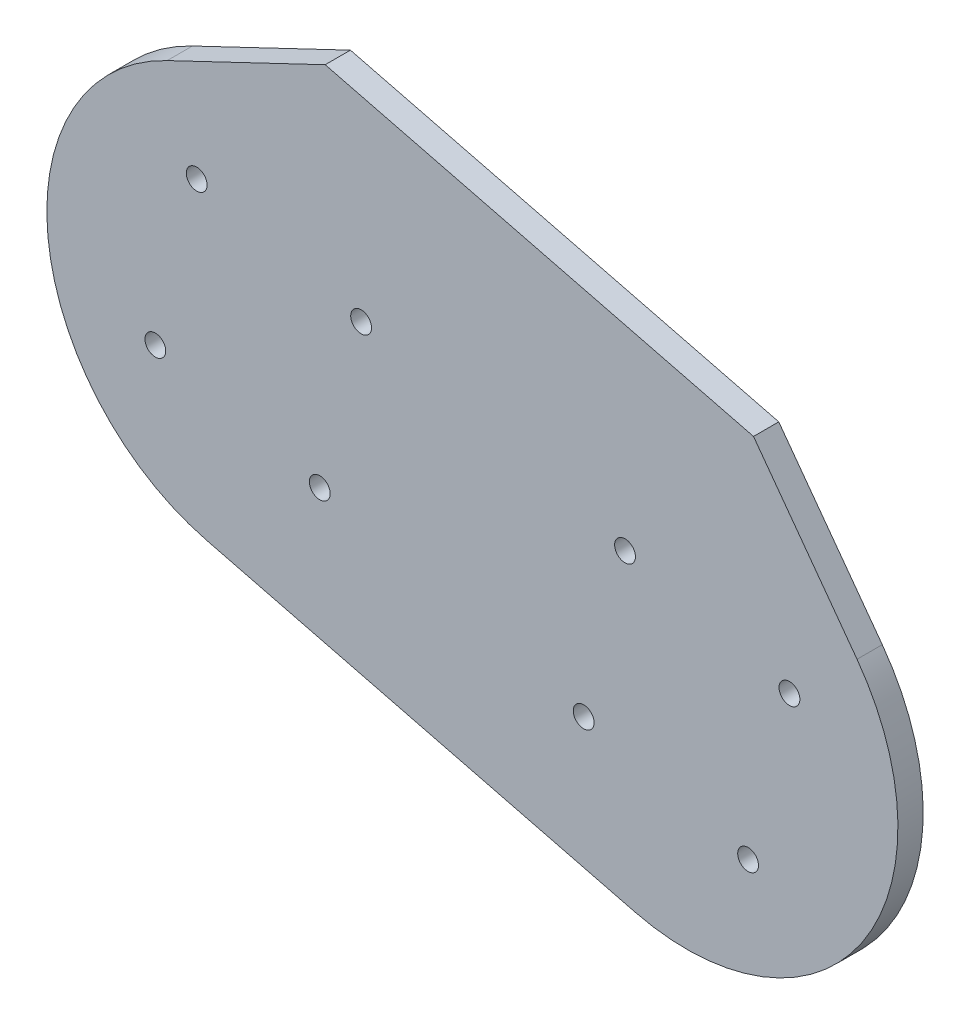
ISO-10303-21;
HEADER;
FILE_DESCRIPTION(('STEP AP214'),'2;1');
FILE_NAME('part.step','',(''),(''),'','','');
FILE_SCHEMA(('AUTOMOTIVE_DESIGN { 1 0 10303 214 1 1 1 1 }'));
ENDSEC;
DATA;
#1=APPLICATION_CONTEXT('core data for automotive mechanical design processes');
#2=APPLICATION_PROTOCOL_DEFINITION('international standard','automotive_design',2000,#1);
#3=PRODUCT_CONTEXT('',#1,'mechanical');
#4=PRODUCT('Part','Part','',(#3));
#5=PRODUCT_RELATED_PRODUCT_CATEGORY('part','',(#4));
#6=PRODUCT_DEFINITION_FORMATION('','',#4);
#7=PRODUCT_DEFINITION_CONTEXT('part definition',#1,'design');
#8=PRODUCT_DEFINITION('design','',#6,#7);
#9=PRODUCT_DEFINITION_SHAPE('','',#8);
#10=(LENGTH_UNIT() NAMED_UNIT(*) SI_UNIT(.MILLI.,.METRE.));
#11=(NAMED_UNIT(*) PLANE_ANGLE_UNIT() SI_UNIT($,.RADIAN.));
#12=(NAMED_UNIT(*) SI_UNIT($,.STERADIAN.) SOLID_ANGLE_UNIT());
#13=UNCERTAINTY_MEASURE_WITH_UNIT(LENGTH_MEASURE(1.E-05),#10,'distance_accuracy_value','');
#14=(GEOMETRIC_REPRESENTATION_CONTEXT(3) GLOBAL_UNCERTAINTY_ASSIGNED_CONTEXT((#13)) GLOBAL_UNIT_ASSIGNED_CONTEXT((#10,
#11,#12)) REPRESENTATION_CONTEXT('',''));
#15=CARTESIAN_POINT('',(0.,0.,0.));
#16=DIRECTION('',(0.,0.,1.));
#17=DIRECTION('',(1.,0.,0.));
#18=AXIS2_PLACEMENT_3D('',#15,#16,#17);
#19=CARTESIAN_POINT('',(365.151200551185,-296.900822554976,4.));
#20=DIRECTION('',(0.,0.,1.));
#21=DIRECTION('',(1.,0.,0.));
#22=AXIS2_PLACEMENT_3D('',#19,#20,#21);
#23=PLANE('',#22);
#24=CARTESIAN_POINT('',(416.729715460648,-323.729030877152,4.));
#25=DIRECTION('',(0.,0.,1.));
#26=DIRECTION('',(1.,0.,0.));
#27=AXIS2_PLACEMENT_3D('',#24,#25,#26);
#28=CIRCLE('',#27,1.64999999999999);
#29=CARTESIAN_POINT('',(418.379715460648,-323.729030877152,4.));
#30=VERTEX_POINT('',#29);
#31=EDGE_CURVE('E207',#30,#30,#28,.T.);
#32=ORIENTED_EDGE('',*,*,#31,.F.);
#33=EDGE_LOOP('',(#32));
#34=FACE_BOUND('',#33,.T.);
#35=CARTESIAN_POINT('',(423.284694528252,-297.67078363327,4.));
#36=DIRECTION('',(0.,0.,1.));
#37=DIRECTION('',(1.,0.,0.));
#38=AXIS2_PLACEMENT_3D('',#35,#36,#37);
#39=CIRCLE('',#38,1.64999999999999);
#40=CARTESIAN_POINT('',(424.934694528252,-297.67078363327,4.));
#41=VERTEX_POINT('',#40);
#42=EDGE_CURVE('E219',#41,#41,#39,.T.);
#43=ORIENTED_EDGE('',*,*,#42,.F.);
#44=EDGE_LOOP('',(#43));
#45=FACE_BOUND('',#44,.T.);
#46=CARTESIAN_POINT('',(348.844587395442,-306.652456643114,4.));
#47=DIRECTION('',(0.,0.,1.));
#48=DIRECTION('',(1.,0.,0.));
#49=AXIS2_PLACEMENT_3D('',#46,#47,#48);
#50=CIRCLE('',#49,1.64999999999999);
#51=CARTESIAN_POINT('',(350.494587395442,-306.652456643114,4.));
#52=VERTEX_POINT('',#51);
#53=EDGE_CURVE('E231',#52,#52,#50,.T.);
#54=ORIENTED_EDGE('',*,*,#53,.F.);
#55=EDGE_LOOP('',(#54));
#56=FACE_BOUND('',#55,.T.);
#57=CARTESIAN_POINT('',(355.399566463046,-280.594209399233,4.));
#58=DIRECTION('',(0.,0.,1.));
#59=DIRECTION('',(1.,0.,0.));
#60=AXIS2_PLACEMENT_3D('',#57,#58,#59);
#61=CIRCLE('',#60,1.64999999999999);
#62=CARTESIAN_POINT('',(357.049566463046,-280.594209399233,4.));
#63=VERTEX_POINT('',#62);
#64=EDGE_CURVE('E124',#63,#63,#61,.T.);
#65=ORIENTED_EDGE('',*,*,#64,.F.);
#66=EDGE_LOOP('',(#65));
#67=FACE_BOUND('',#66,.T.);
#68=DIRECTION('',(-0.90246551540635,-0.430762107783811,0.));
#69=VECTOR('',#68,1.);
#70=CARTESIAN_POINT('',(375.763071682337,-254.715064400169,4.));
#71=LINE('',#70,#69);
#72=CARTESIAN_POINT('',(375.763071682337,-254.715064400169,4.));
#73=VERTEX_POINT('',#72);
#74=CARTESIAN_POINT('',(350.720669940428,-266.668227788863,4.));
#75=VERTEX_POINT('',#74);
#76=EDGE_CURVE('E131',#73,#75,#71,.T.);
#77=ORIENTED_EDGE('',*,*,#76,.T.);
#78=CARTESIAN_POINT('',(365.151200551185,-296.900822554976,4.));
#79=DIRECTION('',(0.,0.,1.));
#80=DIRECTION('',(1.,0.,0.));
#81=AXIS2_PLACEMENT_3D('',#78,#79,#80);
#82=CIRCLE('',#81,33.5);
#83=CARTESIAN_POINT('',(356.978840024896,-329.388705271896,4.));
#84=VERTEX_POINT('',#83);
#85=EDGE_CURVE('E89',#75,#84,#82,.T.);
#86=ORIENTED_EDGE('',*,*,#85,.T.);
#87=DIRECTION('',(0.969787543788656,-0.243951060486251,0.));
#88=VECTOR('',#87,1.);
#89=CARTESIAN_POINT('',(356.978840024896,-329.388705271896,4.));
#90=LINE('',#89,#88);
#91=CARTESIAN_POINT('',(424.863968090102,-346.465279505933,4.));
#92=VERTEX_POINT('',#91);
#93=EDGE_CURVE('E102',#84,#92,#90,.T.);
#94=ORIENTED_EDGE('',*,*,#93,.T.);
#95=CARTESIAN_POINT('',(433.036328616391,-313.977396789013,4.));
#96=DIRECTION('',(0.,0.,1.));
#97=DIRECTION('',(1.,0.,0.));
#98=AXIS2_PLACEMENT_3D('',#95,#96,#97);
#99=CIRCLE('',#98,33.5);
#100=CARTESIAN_POINT('',(460.054173141203,-294.171183692284,4.));
#101=VERTEX_POINT('',#100);
#102=EDGE_CURVE('E96',#92,#101,#99,.T.);
#103=ORIENTED_EDGE('',*,*,#102,.T.);
#104=DIRECTION('',(-0.591230241693418,0.806502821636194,0.));
#105=VECTOR('',#104,1.);
#106=CARTESIAN_POINT('',(443.648199747543,-271.791638634207,4.));
#107=LINE('',#106,#105);
#108=CARTESIAN_POINT('',(443.648199747543,-271.791638634207,4.));
#109=VERTEX_POINT('',#108);
#110=EDGE_CURVE('E100',#101,#109,#107,.T.);
#111=ORIENTED_EDGE('',*,*,#110,.T.);
#112=DIRECTION('',(-0.969787543788655,0.243951060486252,0.));
#113=VECTOR('',#112,1.);
#114=CARTESIAN_POINT('',(375.763071682337,-254.715064400169,4.));
#115=LINE('',#114,#113);
#116=EDGE_CURVE('E52',#109,#73,#115,.T.);
#117=ORIENTED_EDGE('',*,*,#116,.T.);
#118=EDGE_LOOP('',(#77,#86,#94,#103,#111,#117));
#119=FACE_BOUND('',#118,.T.);
#120=CARTESIAN_POINT('',(381.457813706928,-287.149188466837,4.));
#121=DIRECTION('',(0.,0.,1.));
#122=DIRECTION('',(1.,0.,0.));
#123=AXIS2_PLACEMENT_3D('',#120,#121,#122);
#124=CIRCLE('',#123,1.64999999999999);
#125=CARTESIAN_POINT('',(383.107813706928,-287.149188466837,4.));
#126=VERTEX_POINT('',#125);
#127=EDGE_CURVE('E237',#126,#126,#124,.T.);
#128=ORIENTED_EDGE('',*,*,#127,.F.);
#129=EDGE_LOOP('',(#128));
#130=FACE_BOUND('',#129,.T.);
#131=CARTESIAN_POINT('',(374.902834639324,-313.207435710719,4.));
#132=DIRECTION('',(0.,0.,1.));
#133=DIRECTION('',(1.,0.,0.));
#134=AXIS2_PLACEMENT_3D('',#131,#132,#133);
#135=CIRCLE('',#134,1.64999999999999);
#136=CARTESIAN_POINT('',(376.552834639324,-313.207435710719,4.));
#137=VERTEX_POINT('',#136);
#138=EDGE_CURVE('E225',#137,#137,#135,.T.);
#139=ORIENTED_EDGE('',*,*,#138,.F.);
#140=EDGE_LOOP('',(#139));
#141=FACE_BOUND('',#140,.T.);
#142=CARTESIAN_POINT('',(449.342941772134,-304.225762700874,4.));
#143=DIRECTION('',(0.,0.,1.));
#144=DIRECTION('',(1.,0.,0.));
#145=AXIS2_PLACEMENT_3D('',#142,#143,#144);
#146=CIRCLE('',#145,1.64999999999999);
#147=CARTESIAN_POINT('',(450.992941772134,-304.225762700874,4.));
#148=VERTEX_POINT('',#147);
#149=EDGE_CURVE('E213',#148,#148,#146,.T.);
#150=ORIENTED_EDGE('',*,*,#149,.F.);
#151=EDGE_LOOP('',(#150));
#152=FACE_BOUND('',#151,.T.);
#153=CARTESIAN_POINT('',(442.78796270453,-330.284009944756,4.));
#154=DIRECTION('',(0.,0.,1.));
#155=DIRECTION('',(1.,0.,0.));
#156=AXIS2_PLACEMENT_3D('',#153,#154,#155);
#157=CIRCLE('',#156,1.64999999999999);
#158=CARTESIAN_POINT('',(444.43796270453,-330.284009944756,4.));
#159=VERTEX_POINT('',#158);
#160=EDGE_CURVE('E198',#159,#159,#157,.T.);
#161=ORIENTED_EDGE('',*,*,#160,.F.);
#162=EDGE_LOOP('',(#161));
#163=FACE_BOUND('',#162,.T.);
#164=ADVANCED_FACE('F35',(#34,#45,#56,#67,#119,#130,#141,#152,#163),#23,.T.);
#165=CARTESIAN_POINT('',(365.151200551185,-296.900822554976,0.));
#166=DIRECTION('',(0.,0.,1.));
#167=DIRECTION('',(1.,0.,0.));
#168=AXIS2_PLACEMENT_3D('',#165,#166,#167);
#169=PLANE('',#168);
#170=DIRECTION('',(-0.90246551540635,-0.430762107783811,0.));
#171=VECTOR('',#170,1.);
#172=CARTESIAN_POINT('',(375.763071682337,-254.715064400169,0.));
#173=LINE('',#172,#171);
#174=CARTESIAN_POINT('',(375.763071682337,-254.715064400169,0.));
#175=VERTEX_POINT('',#174);
#176=CARTESIAN_POINT('',(350.720669940428,-266.668227788863,0.));
#177=VERTEX_POINT('',#176);
#178=EDGE_CURVE('E120',#175,#177,#173,.T.);
#179=ORIENTED_EDGE('',*,*,#178,.F.);
#180=DIRECTION('',(-0.969787543788655,0.243951060486252,0.));
#181=VECTOR('',#180,1.);
#182=CARTESIAN_POINT('',(375.763071682337,-254.715064400169,0.));
#183=LINE('',#182,#181);
#184=CARTESIAN_POINT('',(443.648199747543,-271.791638634207,0.));
#185=VERTEX_POINT('',#184);
#186=EDGE_CURVE('E81',#185,#175,#183,.T.);
#187=ORIENTED_EDGE('',*,*,#186,.F.);
#188=DIRECTION('',(-0.591230241693418,0.806502821636194,0.));
#189=VECTOR('',#188,1.);
#190=CARTESIAN_POINT('',(443.648199747543,-271.791638634207,0.));
#191=LINE('',#190,#189);
#192=CARTESIAN_POINT('',(460.054173141203,-294.171183692284,0.));
#193=VERTEX_POINT('',#192);
#194=EDGE_CURVE('E75',#193,#185,#191,.T.);
#195=ORIENTED_EDGE('',*,*,#194,.F.);
#196=CARTESIAN_POINT('',(433.036328616391,-313.977396789013,0.));
#197=DIRECTION('',(0.,0.,1.));
#198=DIRECTION('',(1.,0.,0.));
#199=AXIS2_PLACEMENT_3D('',#196,#197,#198);
#200=CIRCLE('',#199,33.5);
#201=CARTESIAN_POINT('',(424.863968090102,-346.465279505933,0.));
#202=VERTEX_POINT('',#201);
#203=EDGE_CURVE('E110',#202,#193,#200,.T.);
#204=ORIENTED_EDGE('',*,*,#203,.F.);
#205=DIRECTION('',(0.969787543788656,-0.243951060486251,0.));
#206=VECTOR('',#205,1.);
#207=CARTESIAN_POINT('',(356.978840024896,-329.388705271896,0.));
#208=LINE('',#207,#206);
#209=CARTESIAN_POINT('',(356.978840024896,-329.388705271896,0.));
#210=VERTEX_POINT('',#209);
#211=EDGE_CURVE('E126',#210,#202,#208,.T.);
#212=ORIENTED_EDGE('',*,*,#211,.F.);
#213=CARTESIAN_POINT('',(365.151200551185,-296.900822554976,0.));
#214=DIRECTION('',(0.,0.,1.));
#215=DIRECTION('',(1.,0.,0.));
#216=AXIS2_PLACEMENT_3D('',#213,#214,#215);
#217=CIRCLE('',#216,33.5);
#218=EDGE_CURVE('E123',#177,#210,#217,.T.);
#219=ORIENTED_EDGE('',*,*,#218,.F.);
#220=EDGE_LOOP('',(#179,#187,#195,#204,#212,#219));
#221=FACE_BOUND('',#220,.T.);
#222=CARTESIAN_POINT('',(355.399566463046,-280.594209399233,0.));
#223=DIRECTION('',(0.,0.,1.));
#224=DIRECTION('',(1.,0.,0.));
#225=AXIS2_PLACEMENT_3D('',#222,#223,#224);
#226=CIRCLE('',#225,1.64999999999999);
#227=CARTESIAN_POINT('',(357.049566463046,-280.594209399233,0.));
#228=VERTEX_POINT('',#227);
#229=EDGE_CURVE('E240',#228,#228,#226,.T.);
#230=ORIENTED_EDGE('',*,*,#229,.T.);
#231=EDGE_LOOP('',(#230));
#232=FACE_BOUND('',#231,.T.);
#233=CARTESIAN_POINT('',(381.457813706928,-287.149188466837,0.));
#234=DIRECTION('',(0.,0.,1.));
#235=DIRECTION('',(1.,0.,0.));
#236=AXIS2_PLACEMENT_3D('',#233,#234,#235);
#237=CIRCLE('',#236,1.64999999999999);
#238=CARTESIAN_POINT('',(383.107813706928,-287.149188466837,0.));
#239=VERTEX_POINT('',#238);
#240=EDGE_CURVE('E234',#239,#239,#237,.T.);
#241=ORIENTED_EDGE('',*,*,#240,.T.);
#242=EDGE_LOOP('',(#241));
#243=FACE_BOUND('',#242,.T.);
#244=CARTESIAN_POINT('',(348.844587395442,-306.652456643114,0.));
#245=DIRECTION('',(0.,0.,1.));
#246=DIRECTION('',(1.,0.,0.));
#247=AXIS2_PLACEMENT_3D('',#244,#245,#246);
#248=CIRCLE('',#247,1.64999999999999);
#249=CARTESIAN_POINT('',(350.494587395442,-306.652456643114,0.));
#250=VERTEX_POINT('',#249);
#251=EDGE_CURVE('E228',#250,#250,#248,.T.);
#252=ORIENTED_EDGE('',*,*,#251,.T.);
#253=EDGE_LOOP('',(#252));
#254=FACE_BOUND('',#253,.T.);
#255=CARTESIAN_POINT('',(374.902834639324,-313.207435710719,0.));
#256=DIRECTION('',(0.,0.,1.));
#257=DIRECTION('',(1.,0.,0.));
#258=AXIS2_PLACEMENT_3D('',#255,#256,#257);
#259=CIRCLE('',#258,1.64999999999999);
#260=CARTESIAN_POINT('',(376.552834639324,-313.207435710719,0.));
#261=VERTEX_POINT('',#260);
#262=EDGE_CURVE('E222',#261,#261,#259,.T.);
#263=ORIENTED_EDGE('',*,*,#262,.T.);
#264=EDGE_LOOP('',(#263));
#265=FACE_BOUND('',#264,.T.);
#266=CARTESIAN_POINT('',(423.284694528252,-297.67078363327,0.));
#267=DIRECTION('',(0.,0.,1.));
#268=DIRECTION('',(1.,0.,0.));
#269=AXIS2_PLACEMENT_3D('',#266,#267,#268);
#270=CIRCLE('',#269,1.64999999999999);
#271=CARTESIAN_POINT('',(424.934694528252,-297.67078363327,0.));
#272=VERTEX_POINT('',#271);
#273=EDGE_CURVE('E216',#272,#272,#270,.T.);
#274=ORIENTED_EDGE('',*,*,#273,.T.);
#275=EDGE_LOOP('',(#274));
#276=FACE_BOUND('',#275,.T.);
#277=CARTESIAN_POINT('',(449.342941772134,-304.225762700874,0.));
#278=DIRECTION('',(0.,0.,1.));
#279=DIRECTION('',(1.,0.,0.));
#280=AXIS2_PLACEMENT_3D('',#277,#278,#279);
#281=CIRCLE('',#280,1.64999999999999);
#282=CARTESIAN_POINT('',(450.992941772134,-304.225762700874,0.));
#283=VERTEX_POINT('',#282);
#284=EDGE_CURVE('E210',#283,#283,#281,.T.);
#285=ORIENTED_EDGE('',*,*,#284,.T.);
#286=EDGE_LOOP('',(#285));
#287=FACE_BOUND('',#286,.T.);
#288=CARTESIAN_POINT('',(416.729715460648,-323.729030877152,0.));
#289=DIRECTION('',(0.,0.,1.));
#290=DIRECTION('',(1.,0.,0.));
#291=AXIS2_PLACEMENT_3D('',#288,#289,#290);
#292=CIRCLE('',#291,1.64999999999999);
#293=CARTESIAN_POINT('',(418.379715460648,-323.729030877152,0.));
#294=VERTEX_POINT('',#293);
#295=EDGE_CURVE('E204',#294,#294,#292,.T.);
#296=ORIENTED_EDGE('',*,*,#295,.T.);
#297=EDGE_LOOP('',(#296));
#298=FACE_BOUND('',#297,.T.);
#299=CARTESIAN_POINT('',(442.78796270453,-330.284009944756,0.));
#300=DIRECTION('',(0.,0.,1.));
#301=DIRECTION('',(1.,0.,0.));
#302=AXIS2_PLACEMENT_3D('',#299,#300,#301);
#303=CIRCLE('',#302,1.64999999999999);
#304=CARTESIAN_POINT('',(444.43796270453,-330.284009944756,0.));
#305=VERTEX_POINT('',#304);
#306=EDGE_CURVE('E201',#305,#305,#303,.T.);
#307=ORIENTED_EDGE('',*,*,#306,.T.);
#308=EDGE_LOOP('',(#307));
#309=FACE_BOUND('',#308,.T.);
#310=ADVANCED_FACE('F140',(#221,#232,#243,#254,#265,#276,#287,#298,#309),#169,.F.);
#311=CARTESIAN_POINT('',(375.763071682337,-254.715064400169,4.));
#312=DIRECTION('',(0.430762107783811,-0.90246551540635,0.));
#313=DIRECTION('',(0.90246551540635,0.430762107783811,0.));
#314=AXIS2_PLACEMENT_3D('',#311,#312,#313);
#315=PLANE('',#314);
#316=ORIENTED_EDGE('',*,*,#178,.T.);
#317=DIRECTION('',(0.,0.,-1.));
#318=VECTOR('',#317,1.);
#319=CARTESIAN_POINT('',(350.720669940428,-266.668227788863,4.));
#320=LINE('',#319,#318);
#321=EDGE_CURVE('E11',#75,#177,#320,.T.);
#322=ORIENTED_EDGE('',*,*,#321,.F.);
#323=ORIENTED_EDGE('',*,*,#76,.F.);
#324=DIRECTION('',(0.,0.,-1.));
#325=VECTOR('',#324,1.);
#326=CARTESIAN_POINT('',(375.763071682337,-254.715064400169,4.));
#327=LINE('',#326,#325);
#328=EDGE_CURVE('E116',#73,#175,#327,.T.);
#329=ORIENTED_EDGE('',*,*,#328,.T.);
#330=EDGE_LOOP('',(#316,#322,#323,#329));
#331=FACE_BOUND('',#330,.T.);
#332=ADVANCED_FACE('F37',(#331),#315,.F.);
#333=CARTESIAN_POINT('',(365.151200551185,-296.900822554976,4.));
#334=DIRECTION('',(0.,0.,-1.));
#335=DIRECTION('',(-1.,0.,0.));
#336=AXIS2_PLACEMENT_3D('',#333,#334,#335);
#337=CYLINDRICAL_SURFACE('',#336,33.5);
#338=ORIENTED_EDGE('',*,*,#218,.T.);
#339=DIRECTION('',(0.,0.,-1.));
#340=VECTOR('',#339,1.);
#341=CARTESIAN_POINT('',(356.978840024896,-329.388705271896,4.));
#342=LINE('',#341,#340);
#343=EDGE_CURVE('E44',#84,#210,#342,.T.);
#344=ORIENTED_EDGE('',*,*,#343,.F.);
#345=ORIENTED_EDGE('',*,*,#85,.F.);
#346=ORIENTED_EDGE('',*,*,#321,.T.);
#347=EDGE_LOOP('',(#338,#344,#345,#346));
#348=FACE_BOUND('',#347,.T.);
#349=ADVANCED_FACE('F334',(#348),#337,.T.);
#350=CARTESIAN_POINT('',(356.978840024896,-329.388705271896,4.));
#351=DIRECTION('',(0.243951060486251,0.969787543788656,0.));
#352=DIRECTION('',(-0.969787543788656,0.243951060486251,0.));
#353=AXIS2_PLACEMENT_3D('',#350,#351,#352);
#354=PLANE('',#353);
#355=ORIENTED_EDGE('',*,*,#211,.T.);
#356=DIRECTION('',(0.,0.,-1.));
#357=VECTOR('',#356,1.);
#358=CARTESIAN_POINT('',(424.863968090102,-346.465279505933,4.));
#359=LINE('',#358,#357);
#360=EDGE_CURVE('E111',#92,#202,#359,.T.);
#361=ORIENTED_EDGE('',*,*,#360,.F.);
#362=ORIENTED_EDGE('',*,*,#93,.F.);
#363=ORIENTED_EDGE('',*,*,#343,.T.);
#364=EDGE_LOOP('',(#355,#361,#362,#363));
#365=FACE_BOUND('',#364,.T.);
#366=ADVANCED_FACE('F137',(#365),#354,.F.);
#367=CARTESIAN_POINT('',(433.036328616391,-313.977396789013,4.));
#368=DIRECTION('',(0.,0.,-1.));
#369=DIRECTION('',(-1.,0.,0.));
#370=AXIS2_PLACEMENT_3D('',#367,#368,#369);
#371=CYLINDRICAL_SURFACE('',#370,33.5);
#372=ORIENTED_EDGE('',*,*,#203,.T.);
#373=DIRECTION('',(0.,0.,-1.));
#374=VECTOR('',#373,1.);
#375=CARTESIAN_POINT('',(460.054173141203,-294.171183692284,4.));
#376=LINE('',#375,#374);
#377=EDGE_CURVE('E107',#101,#193,#376,.T.);
#378=ORIENTED_EDGE('',*,*,#377,.F.);
#379=ORIENTED_EDGE('',*,*,#102,.F.);
#380=ORIENTED_EDGE('',*,*,#360,.T.);
#381=EDGE_LOOP('',(#372,#378,#379,#380));
#382=FACE_BOUND('',#381,.T.);
#383=ADVANCED_FACE('F108',(#382),#371,.T.);
#384=CARTESIAN_POINT('',(443.648199747543,-271.791638634207,4.));
#385=DIRECTION('',(-0.806502821636194,-0.591230241693418,0.));
#386=DIRECTION('',(0.591230241693418,-0.806502821636194,0.));
#387=AXIS2_PLACEMENT_3D('',#384,#385,#386);
#388=PLANE('',#387);
#389=ORIENTED_EDGE('',*,*,#194,.T.);
#390=DIRECTION('',(0.,0.,-1.));
#391=VECTOR('',#390,1.);
#392=CARTESIAN_POINT('',(443.648199747543,-271.791638634207,4.));
#393=LINE('',#392,#391);
#394=EDGE_CURVE('E112',#109,#185,#393,.T.);
#395=ORIENTED_EDGE('',*,*,#394,.F.);
#396=ORIENTED_EDGE('',*,*,#110,.F.);
#397=ORIENTED_EDGE('',*,*,#377,.T.);
#398=EDGE_LOOP('',(#389,#395,#396,#397));
#399=FACE_BOUND('',#398,.T.);
#400=ADVANCED_FACE('F114',(#399),#388,.F.);
#401=CARTESIAN_POINT('',(375.763071682337,-254.715064400169,4.));
#402=DIRECTION('',(-0.243951060486252,-0.969787543788655,0.));
#403=DIRECTION('',(0.969787543788655,-0.243951060486252,0.));
#404=AXIS2_PLACEMENT_3D('',#401,#402,#403);
#405=PLANE('',#404);
#406=ORIENTED_EDGE('',*,*,#186,.T.);
#407=ORIENTED_EDGE('',*,*,#328,.F.);
#408=ORIENTED_EDGE('',*,*,#116,.F.);
#409=ORIENTED_EDGE('',*,*,#394,.T.);
#410=EDGE_LOOP('',(#406,#407,#408,#409));
#411=FACE_BOUND('',#410,.T.);
#412=ADVANCED_FACE('F145',(#411),#405,.F.);
#413=CARTESIAN_POINT('',(355.399566463046,-280.594209399233,4.));
#414=DIRECTION('',(0.,0.,-1.));
#415=DIRECTION('',(-1.,0.,0.));
#416=AXIS2_PLACEMENT_3D('',#413,#414,#415);
#417=CYLINDRICAL_SURFACE('',#416,1.64999999999999);
#418=ORIENTED_EDGE('',*,*,#64,.T.);
#419=EDGE_LOOP('',(#418));
#420=FACE_BOUND('',#419,.T.);
#421=ORIENTED_EDGE('',*,*,#229,.F.);
#422=EDGE_LOOP('',(#421));
#423=FACE_BOUND('',#422,.T.);
#424=ADVANCED_FACE('F147',(#420,#423),#417,.F.);
#425=CARTESIAN_POINT('',(381.457813706928,-287.149188466837,4.));
#426=DIRECTION('',(0.,0.,-1.));
#427=DIRECTION('',(-1.,0.,0.));
#428=AXIS2_PLACEMENT_3D('',#425,#426,#427);
#429=CYLINDRICAL_SURFACE('',#428,1.64999999999999);
#430=ORIENTED_EDGE('',*,*,#127,.T.);
#431=EDGE_LOOP('',(#430));
#432=FACE_BOUND('',#431,.T.);
#433=ORIENTED_EDGE('',*,*,#240,.F.);
#434=EDGE_LOOP('',(#433));
#435=FACE_BOUND('',#434,.T.);
#436=ADVANCED_FACE('F153',(#432,#435),#429,.F.);
#437=CARTESIAN_POINT('',(348.844587395442,-306.652456643114,4.));
#438=DIRECTION('',(0.,0.,-1.));
#439=DIRECTION('',(-1.,0.,0.));
#440=AXIS2_PLACEMENT_3D('',#437,#438,#439);
#441=CYLINDRICAL_SURFACE('',#440,1.64999999999999);
#442=ORIENTED_EDGE('',*,*,#53,.T.);
#443=EDGE_LOOP('',(#442));
#444=FACE_BOUND('',#443,.T.);
#445=ORIENTED_EDGE('',*,*,#251,.F.);
#446=EDGE_LOOP('',(#445));
#447=FACE_BOUND('',#446,.T.);
#448=ADVANCED_FACE('F169',(#444,#447),#441,.F.);
#449=CARTESIAN_POINT('',(374.902834639324,-313.207435710719,4.));
#450=DIRECTION('',(0.,0.,-1.));
#451=DIRECTION('',(-1.,0.,0.));
#452=AXIS2_PLACEMENT_3D('',#449,#450,#451);
#453=CYLINDRICAL_SURFACE('',#452,1.64999999999999);
#454=ORIENTED_EDGE('',*,*,#138,.T.);
#455=EDGE_LOOP('',(#454));
#456=FACE_BOUND('',#455,.T.);
#457=ORIENTED_EDGE('',*,*,#262,.F.);
#458=EDGE_LOOP('',(#457));
#459=FACE_BOUND('',#458,.T.);
#460=ADVANCED_FACE('F173',(#456,#459),#453,.F.);
#461=CARTESIAN_POINT('',(423.284694528252,-297.67078363327,4.));
#462=DIRECTION('',(0.,0.,-1.));
#463=DIRECTION('',(-1.,0.,0.));
#464=AXIS2_PLACEMENT_3D('',#461,#462,#463);
#465=CYLINDRICAL_SURFACE('',#464,1.64999999999999);
#466=ORIENTED_EDGE('',*,*,#42,.T.);
#467=EDGE_LOOP('',(#466));
#468=FACE_BOUND('',#467,.T.);
#469=ORIENTED_EDGE('',*,*,#273,.F.);
#470=EDGE_LOOP('',(#469));
#471=FACE_BOUND('',#470,.T.);
#472=ADVANCED_FACE('F177',(#468,#471),#465,.F.);
#473=CARTESIAN_POINT('',(449.342941772134,-304.225762700874,4.));
#474=DIRECTION('',(0.,0.,-1.));
#475=DIRECTION('',(-1.,0.,0.));
#476=AXIS2_PLACEMENT_3D('',#473,#474,#475);
#477=CYLINDRICAL_SURFACE('',#476,1.64999999999999);
#478=ORIENTED_EDGE('',*,*,#149,.T.);
#479=EDGE_LOOP('',(#478));
#480=FACE_BOUND('',#479,.T.);
#481=ORIENTED_EDGE('',*,*,#284,.F.);
#482=EDGE_LOOP('',(#481));
#483=FACE_BOUND('',#482,.T.);
#484=ADVANCED_FACE('F181',(#480,#483),#477,.F.);
#485=CARTESIAN_POINT('',(416.729715460648,-323.729030877152,4.));
#486=DIRECTION('',(0.,0.,-1.));
#487=DIRECTION('',(-1.,0.,0.));
#488=AXIS2_PLACEMENT_3D('',#485,#486,#487);
#489=CYLINDRICAL_SURFACE('',#488,1.64999999999999);
#490=ORIENTED_EDGE('',*,*,#31,.T.);
#491=EDGE_LOOP('',(#490));
#492=FACE_BOUND('',#491,.T.);
#493=ORIENTED_EDGE('',*,*,#295,.F.);
#494=EDGE_LOOP('',(#493));
#495=FACE_BOUND('',#494,.T.);
#496=ADVANCED_FACE('F185',(#492,#495),#489,.F.);
#497=CARTESIAN_POINT('',(442.78796270453,-330.284009944756,4.));
#498=DIRECTION('',(0.,0.,-1.));
#499=DIRECTION('',(-1.,0.,0.));
#500=AXIS2_PLACEMENT_3D('',#497,#498,#499);
#501=CYLINDRICAL_SURFACE('',#500,1.64999999999999);
#502=ORIENTED_EDGE('',*,*,#160,.T.);
#503=EDGE_LOOP('',(#502));
#504=FACE_BOUND('',#503,.T.);
#505=ORIENTED_EDGE('',*,*,#306,.F.);
#506=EDGE_LOOP('',(#505));
#507=FACE_BOUND('',#506,.T.);
#508=ADVANCED_FACE('F189',(#504,#507),#501,.F.);
#509=CLOSED_SHELL('',(#164,#310,#332,#349,#366,#383,#400,#412,#424,#436,#448,#460,#472,#484,
#496,#508));
#510=MANIFOLD_SOLID_BREP('B2',#509);
#511=ADVANCED_BREP_SHAPE_REPRESENTATION('',(#18,#510),#14);
#512=SHAPE_DEFINITION_REPRESENTATION(#9,#511);
ENDSEC;
END-ISO-10303-21;
